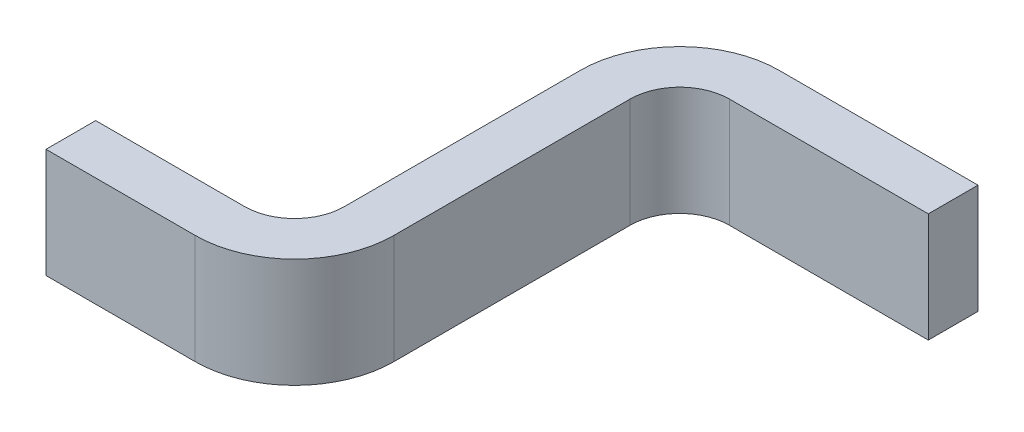
ISO-10303-21;
HEADER;
FILE_DESCRIPTION(('STEP AP214'),'2;1');
FILE_NAME('part.step','',(''),(''),'','','');
FILE_SCHEMA(('AUTOMOTIVE_DESIGN { 1 0 10303 214 1 1 1 1 }'));
ENDSEC;
DATA;
#1=APPLICATION_CONTEXT('core data for automotive mechanical design processes');
#2=APPLICATION_PROTOCOL_DEFINITION('international standard','automotive_design',2000,#1);
#3=PRODUCT_CONTEXT('',#1,'mechanical');
#4=PRODUCT('Part','Part','',(#3));
#5=PRODUCT_RELATED_PRODUCT_CATEGORY('part','',(#4));
#6=PRODUCT_DEFINITION_FORMATION('','',#4);
#7=PRODUCT_DEFINITION_CONTEXT('part definition',#1,'design');
#8=PRODUCT_DEFINITION('design','',#6,#7);
#9=PRODUCT_DEFINITION_SHAPE('','',#8);
#10=(LENGTH_UNIT() NAMED_UNIT(*) SI_UNIT(.MILLI.,.METRE.));
#11=(NAMED_UNIT(*) PLANE_ANGLE_UNIT() SI_UNIT($,.RADIAN.));
#12=(NAMED_UNIT(*) SI_UNIT($,.STERADIAN.) SOLID_ANGLE_UNIT());
#13=UNCERTAINTY_MEASURE_WITH_UNIT(LENGTH_MEASURE(1.E-05),#10,'distance_accuracy_value','');
#14=(GEOMETRIC_REPRESENTATION_CONTEXT(3) GLOBAL_UNCERTAINTY_ASSIGNED_CONTEXT((#13)) GLOBAL_UNIT_ASSIGNED_CONTEXT((#10,
#11,#12)) REPRESENTATION_CONTEXT('',''));
#15=CARTESIAN_POINT('',(0.,0.,0.));
#16=DIRECTION('',(0.,0.,1.));
#17=DIRECTION('',(1.,0.,0.));
#18=AXIS2_PLACEMENT_3D('',#15,#16,#17);
#19=CARTESIAN_POINT('',(3.9,-0.14,0.675));
#20=DIRECTION('',(0.,-1.,0.));
#21=DIRECTION('',(0.,0.,-1.));
#22=AXIS2_PLACEMENT_3D('',#19,#20,#21);
#23=PLANE('',#22);
#24=CARTESIAN_POINT('',(3.8,-0.14,0.675));
#25=DIRECTION('',(0.,-1.,0.));
#26=DIRECTION('',(0.,0.,-1.));
#27=AXIS2_PLACEMENT_3D('',#24,#25,#26);
#28=CIRCLE('',#27,0.1);
#29=CARTESIAN_POINT('',(3.9,-0.14,0.675));
#30=VERTEX_POINT('',#29);
#31=CARTESIAN_POINT('',(3.8,-0.14,0.775));
#32=VERTEX_POINT('',#31);
#33=EDGE_CURVE('E162',#30,#32,#28,.T.);
#34=ORIENTED_EDGE('',*,*,#33,.T.);
#35=DIRECTION('',(1.,0.,0.));
#36=VECTOR('',#35,1.);
#37=CARTESIAN_POINT('',(3.5,-0.14,0.775));
#38=LINE('',#37,#36);
#39=CARTESIAN_POINT('',(3.5,-0.14,0.775));
#40=VERTEX_POINT('',#39);
#41=EDGE_CURVE('E120',#32,#40,#38,.F.);
#42=ORIENTED_EDGE('',*,*,#41,.T.);
#43=DIRECTION('',(0.,0.,1.));
#44=VECTOR('',#43,1.);
#45=CARTESIAN_POINT('',(3.5,-0.14,0.775));
#46=LINE('',#45,#44);
#47=CARTESIAN_POINT('',(3.5,-0.14,0.875));
#48=VERTEX_POINT('',#47);
#49=EDGE_CURVE('E116',#48,#40,#46,.F.);
#50=ORIENTED_EDGE('',*,*,#49,.F.);
#51=DIRECTION('',(-1.,0.,0.));
#52=VECTOR('',#51,1.);
#53=CARTESIAN_POINT('',(3.5,-0.14,0.875));
#54=LINE('',#53,#52);
#55=CARTESIAN_POINT('',(3.8,-0.14,0.875));
#56=VERTEX_POINT('',#55);
#57=EDGE_CURVE('E111',#48,#56,#54,.F.);
#58=ORIENTED_EDGE('',*,*,#57,.T.);
#59=CARTESIAN_POINT('',(3.8,-0.14,0.675));
#60=DIRECTION('',(0.,-1.,0.));
#61=DIRECTION('',(0.,0.,-1.));
#62=AXIS2_PLACEMENT_3D('',#59,#60,#61);
#63=CIRCLE('',#62,0.2);
#64=CARTESIAN_POINT('',(4.,-0.14,0.675));
#65=VERTEX_POINT('',#64);
#66=EDGE_CURVE('E102',#65,#56,#63,.T.);
#67=ORIENTED_EDGE('',*,*,#66,.F.);
#68=DIRECTION('',(0.,0.,1.));
#69=VECTOR('',#68,1.);
#70=CARTESIAN_POINT('',(4.,-0.14,0.675));
#71=LINE('',#70,#69);
#72=CARTESIAN_POINT('',(4.,-0.14,0.2));
#73=VERTEX_POINT('',#72);
#74=EDGE_CURVE('E98',#65,#73,#71,.F.);
#75=ORIENTED_EDGE('',*,*,#74,.T.);
#76=CARTESIAN_POINT('',(4.1,-0.14,0.2));
#77=DIRECTION('',(0.,1.,0.));
#78=DIRECTION('',(0.,0.,1.));
#79=AXIS2_PLACEMENT_3D('',#76,#77,#78);
#80=CIRCLE('',#79,0.1);
#81=CARTESIAN_POINT('',(4.1,-0.14,0.1));
#82=VERTEX_POINT('',#81);
#83=EDGE_CURVE('E20',#73,#82,#80,.F.);
#84=ORIENTED_EDGE('',*,*,#83,.T.);
#85=DIRECTION('',(-1.,0.,0.));
#86=VECTOR('',#85,1.);
#87=CARTESIAN_POINT('',(4.1,-0.14,0.1));
#88=LINE('',#87,#86);
#89=CARTESIAN_POINT('',(4.5,-0.14,0.1));
#90=VERTEX_POINT('',#89);
#91=EDGE_CURVE('E145',#82,#90,#88,.F.);
#92=ORIENTED_EDGE('',*,*,#91,.T.);
#93=DIRECTION('',(0.,0.,1.));
#94=VECTOR('',#93,1.);
#95=CARTESIAN_POINT('',(4.5,-0.14,0.));
#96=LINE('',#95,#94);
#97=CARTESIAN_POINT('',(4.5,-0.14,0.));
#98=VERTEX_POINT('',#97);
#99=EDGE_CURVE('E139',#90,#98,#96,.F.);
#100=ORIENTED_EDGE('',*,*,#99,.T.);
#101=DIRECTION('',(1.,0.,0.));
#102=VECTOR('',#101,1.);
#103=CARTESIAN_POINT('',(4.1,-0.14,0.));
#104=LINE('',#103,#102);
#105=CARTESIAN_POINT('',(4.1,-0.14,0.));
#106=VERTEX_POINT('',#105);
#107=EDGE_CURVE('E132',#98,#106,#104,.F.);
#108=ORIENTED_EDGE('',*,*,#107,.T.);
#109=CARTESIAN_POINT('',(4.1,-0.14,0.2));
#110=DIRECTION('',(0.,1.,0.));
#111=DIRECTION('',(0.,0.,1.));
#112=AXIS2_PLACEMENT_3D('',#109,#110,#111);
#113=CIRCLE('',#112,0.2);
#114=CARTESIAN_POINT('',(3.9,-0.14,0.2));
#115=VERTEX_POINT('',#114);
#116=EDGE_CURVE('E135',#115,#106,#113,.F.);
#117=ORIENTED_EDGE('',*,*,#116,.F.);
#118=DIRECTION('',(0.,0.,-1.));
#119=VECTOR('',#118,1.);
#120=CARTESIAN_POINT('',(3.9,-0.14,0.675));
#121=LINE('',#120,#119);
#122=EDGE_CURVE('E128',#115,#30,#121,.F.);
#123=ORIENTED_EDGE('',*,*,#122,.T.);
#124=EDGE_LOOP('',(#34,#42,#50,#58,#67,#75,#84,#92,#100,#108,#117,#123));
#125=FACE_BOUND('',#124,.T.);
#126=ADVANCED_FACE('F17',(#125),#23,.F.);
#127=CARTESIAN_POINT('',(4.1,-0.14,0.2));
#128=DIRECTION('',(0.,1.,0.));
#129=DIRECTION('',(0.,0.,1.));
#130=AXIS2_PLACEMENT_3D('',#127,#128,#129);
#131=CYLINDRICAL_SURFACE('',#130,0.1);
#132=DIRECTION('',(0.,1.,0.));
#133=VECTOR('',#132,1.);
#134=CARTESIAN_POINT('',(4.,-0.14,0.2));
#135=LINE('',#134,#133);
#136=CARTESIAN_POINT('',(4.,-0.36,0.2));
#137=VERTEX_POINT('',#136);
#138=EDGE_CURVE('E91',#73,#137,#135,.F.);
#139=ORIENTED_EDGE('',*,*,#138,.T.);
#140=CARTESIAN_POINT('',(4.1,-0.36,0.2));
#141=DIRECTION('',(0.,1.,0.));
#142=DIRECTION('',(0.,0.,1.));
#143=AXIS2_PLACEMENT_3D('',#140,#141,#142);
#144=CIRCLE('',#143,0.1);
#145=CARTESIAN_POINT('',(4.1,-0.36,0.1));
#146=VERTEX_POINT('',#145);
#147=EDGE_CURVE('E103',#137,#146,#144,.F.);
#148=ORIENTED_EDGE('',*,*,#147,.T.);
#149=DIRECTION('',(0.,1.,0.));
#150=VECTOR('',#149,1.);
#151=CARTESIAN_POINT('',(4.1,-0.14,0.1));
#152=LINE('',#151,#150);
#153=EDGE_CURVE('E92',#146,#82,#152,.T.);
#154=ORIENTED_EDGE('',*,*,#153,.T.);
#155=ORIENTED_EDGE('',*,*,#83,.F.);
#156=EDGE_LOOP('',(#139,#148,#154,#155));
#157=FACE_BOUND('',#156,.T.);
#158=ADVANCED_FACE('F89',(#157),#131,.F.);
#159=CARTESIAN_POINT('',(4.1,-0.14,0.1));
#160=DIRECTION('',(0.,0.,-1.));
#161=DIRECTION('',(-1.,0.,0.));
#162=AXIS2_PLACEMENT_3D('',#159,#160,#161);
#163=PLANE('',#162);
#164=ORIENTED_EDGE('',*,*,#153,.F.);
#165=DIRECTION('',(1.,0.,0.));
#166=VECTOR('',#165,1.);
#167=CARTESIAN_POINT('',(4.,-0.36,0.1));
#168=LINE('',#167,#166);
#169=CARTESIAN_POINT('',(4.5,-0.36,0.1));
#170=VERTEX_POINT('',#169);
#171=EDGE_CURVE('E105',#146,#170,#168,.T.);
#172=ORIENTED_EDGE('',*,*,#171,.T.);
#173=DIRECTION('',(0.,1.,0.));
#174=VECTOR('',#173,1.);
#175=CARTESIAN_POINT('',(4.5,-0.36,0.1));
#176=LINE('',#175,#174);
#177=EDGE_CURVE('E142',#170,#90,#176,.T.);
#178=ORIENTED_EDGE('',*,*,#177,.T.);
#179=ORIENTED_EDGE('',*,*,#91,.F.);
#180=EDGE_LOOP('',(#164,#172,#178,#179));
#181=FACE_BOUND('',#180,.T.);
#182=ADVANCED_FACE('F187',(#181),#163,.F.);
#183=CARTESIAN_POINT('',(4.5,-0.36,0.));
#184=DIRECTION('',(-1.,0.,0.));
#185=DIRECTION('',(0.,0.,1.));
#186=AXIS2_PLACEMENT_3D('',#183,#184,#185);
#187=PLANE('',#186);
#188=ORIENTED_EDGE('',*,*,#177,.F.);
#189=DIRECTION('',(0.,0.,1.));
#190=VECTOR('',#189,1.);
#191=CARTESIAN_POINT('',(4.5,-0.36,0.675));
#192=LINE('',#191,#190);
#193=CARTESIAN_POINT('',(4.5,-0.36,0.));
#194=VERTEX_POINT('',#193);
#195=EDGE_CURVE('E176',#170,#194,#192,.F.);
#196=ORIENTED_EDGE('',*,*,#195,.T.);
#197=DIRECTION('',(0.,1.,0.));
#198=VECTOR('',#197,1.);
#199=CARTESIAN_POINT('',(4.5,-0.36,0.));
#200=LINE('',#199,#198);
#201=EDGE_CURVE('E136',#194,#98,#200,.T.);
#202=ORIENTED_EDGE('',*,*,#201,.T.);
#203=ORIENTED_EDGE('',*,*,#99,.F.);
#204=EDGE_LOOP('',(#188,#196,#202,#203));
#205=FACE_BOUND('',#204,.T.);
#206=ADVANCED_FACE('F192',(#205),#187,.F.);
#207=CARTESIAN_POINT('',(4.1,-0.36,0.));
#208=DIRECTION('',(0.,0.,1.));
#209=DIRECTION('',(1.,0.,0.));
#210=AXIS2_PLACEMENT_3D('',#207,#208,#209);
#211=PLANE('',#210);
#212=DIRECTION('',(0.,1.,0.));
#213=VECTOR('',#212,1.);
#214=CARTESIAN_POINT('',(4.1,-0.36,0.));
#215=LINE('',#214,#213);
#216=CARTESIAN_POINT('',(4.1,-0.36,0.));
#217=VERTEX_POINT('',#216);
#218=EDGE_CURVE('E163',#106,#217,#215,.F.);
#219=ORIENTED_EDGE('',*,*,#218,.F.);
#220=ORIENTED_EDGE('',*,*,#107,.F.);
#221=ORIENTED_EDGE('',*,*,#201,.F.);
#222=DIRECTION('',(1.,0.,0.));
#223=VECTOR('',#222,1.);
#224=CARTESIAN_POINT('',(4.,-0.36,0.));
#225=LINE('',#224,#223);
#226=EDGE_CURVE('E159',#194,#217,#225,.F.);
#227=ORIENTED_EDGE('',*,*,#226,.T.);
#228=EDGE_LOOP('',(#219,#220,#221,#227));
#229=FACE_BOUND('',#228,.T.);
#230=ADVANCED_FACE('F264',(#229),#211,.F.);
#231=CARTESIAN_POINT('',(4.1,-0.36,0.2));
#232=DIRECTION('',(0.,1.,0.));
#233=DIRECTION('',(0.,0.,1.));
#234=AXIS2_PLACEMENT_3D('',#231,#232,#233);
#235=CYLINDRICAL_SURFACE('',#234,0.2);
#236=ORIENTED_EDGE('',*,*,#116,.T.);
#237=ORIENTED_EDGE('',*,*,#218,.T.);
#238=CARTESIAN_POINT('',(4.1,-0.36,0.2));
#239=DIRECTION('',(0.,1.,0.));
#240=DIRECTION('',(0.,0.,1.));
#241=AXIS2_PLACEMENT_3D('',#238,#239,#240);
#242=CIRCLE('',#241,0.2);
#243=CARTESIAN_POINT('',(3.9,-0.36,0.2));
#244=VERTEX_POINT('',#243);
#245=EDGE_CURVE('E157',#217,#244,#242,.T.);
#246=ORIENTED_EDGE('',*,*,#245,.T.);
#247=DIRECTION('',(0.,1.,0.));
#248=VECTOR('',#247,1.);
#249=CARTESIAN_POINT('',(3.9,-0.36,0.2));
#250=LINE('',#249,#248);
#251=EDGE_CURVE('E131',#244,#115,#250,.T.);
#252=ORIENTED_EDGE('',*,*,#251,.T.);
#253=EDGE_LOOP('',(#236,#237,#246,#252));
#254=FACE_BOUND('',#253,.T.);
#255=ADVANCED_FACE('F266',(#254),#235,.T.);
#256=CARTESIAN_POINT('',(3.9,-0.36,0.675));
#257=DIRECTION('',(1.,0.,0.));
#258=DIRECTION('',(0.,0.,-1.));
#259=AXIS2_PLACEMENT_3D('',#256,#257,#258);
#260=PLANE('',#259);
#261=DIRECTION('',(0.,-1.,0.));
#262=VECTOR('',#261,1.);
#263=CARTESIAN_POINT('',(3.9,-0.36,0.675));
#264=LINE('',#263,#262);
#265=CARTESIAN_POINT('',(3.9,-0.36,0.675));
#266=VERTEX_POINT('',#265);
#267=EDGE_CURVE('E130',#266,#30,#264,.F.);
#268=ORIENTED_EDGE('',*,*,#267,.T.);
#269=ORIENTED_EDGE('',*,*,#122,.F.);
#270=ORIENTED_EDGE('',*,*,#251,.F.);
#271=DIRECTION('',(0.,0.,1.));
#272=VECTOR('',#271,1.);
#273=CARTESIAN_POINT('',(3.9,-0.36,0.675));
#274=LINE('',#273,#272);
#275=EDGE_CURVE('E156',#244,#266,#274,.T.);
#276=ORIENTED_EDGE('',*,*,#275,.T.);
#277=EDGE_LOOP('',(#268,#269,#270,#276));
#278=FACE_BOUND('',#277,.T.);
#279=ADVANCED_FACE('F231',(#278),#260,.F.);
#280=CARTESIAN_POINT('',(3.8,-0.36,0.675));
#281=DIRECTION('',(0.,-1.,0.));
#282=DIRECTION('',(0.,0.,-1.));
#283=AXIS2_PLACEMENT_3D('',#280,#281,#282);
#284=CYLINDRICAL_SURFACE('',#283,0.1);
#285=DIRECTION('',(0.,1.,0.));
#286=VECTOR('',#285,1.);
#287=CARTESIAN_POINT('',(3.8,-0.36,0.775));
#288=LINE('',#287,#286);
#289=CARTESIAN_POINT('',(3.8,-0.36,0.775));
#290=VERTEX_POINT('',#289);
#291=EDGE_CURVE('E125',#290,#32,#288,.T.);
#292=ORIENTED_EDGE('',*,*,#291,.T.);
#293=ORIENTED_EDGE('',*,*,#33,.F.);
#294=ORIENTED_EDGE('',*,*,#267,.F.);
#295=CARTESIAN_POINT('',(3.8,-0.36,0.675));
#296=DIRECTION('',(0.,-1.,0.));
#297=DIRECTION('',(0.,0.,-1.));
#298=AXIS2_PLACEMENT_3D('',#295,#296,#297);
#299=CIRCLE('',#298,0.1);
#300=EDGE_CURVE('E152',#266,#290,#299,.T.);
#301=ORIENTED_EDGE('',*,*,#300,.T.);
#302=EDGE_LOOP('',(#292,#293,#294,#301));
#303=FACE_BOUND('',#302,.T.);
#304=ADVANCED_FACE('F235',(#303),#284,.F.);
#305=CARTESIAN_POINT('',(3.5,-0.36,0.775));
#306=DIRECTION('',(0.,0.,1.));
#307=DIRECTION('',(1.,0.,0.));
#308=AXIS2_PLACEMENT_3D('',#305,#306,#307);
#309=PLANE('',#308);
#310=DIRECTION('',(0.,1.,0.));
#311=VECTOR('',#310,1.);
#312=CARTESIAN_POINT('',(3.5,-0.36,0.775));
#313=LINE('',#312,#311);
#314=CARTESIAN_POINT('',(3.5,-0.36,0.775));
#315=VERTEX_POINT('',#314);
#316=EDGE_CURVE('E119',#40,#315,#313,.F.);
#317=ORIENTED_EDGE('',*,*,#316,.F.);
#318=ORIENTED_EDGE('',*,*,#41,.F.);
#319=ORIENTED_EDGE('',*,*,#291,.F.);
#320=DIRECTION('',(1.,0.,0.));
#321=VECTOR('',#320,1.);
#322=CARTESIAN_POINT('',(4.,-0.36,0.775));
#323=LINE('',#322,#321);
#324=EDGE_CURVE('E155',#290,#315,#323,.F.);
#325=ORIENTED_EDGE('',*,*,#324,.T.);
#326=EDGE_LOOP('',(#317,#318,#319,#325));
#327=FACE_BOUND('',#326,.T.);
#328=ADVANCED_FACE('F259',(#327),#309,.F.);
#329=CARTESIAN_POINT('',(3.5,-0.36,0.775));
#330=DIRECTION('',(-1.,0.,0.));
#331=DIRECTION('',(0.,0.,1.));
#332=AXIS2_PLACEMENT_3D('',#329,#330,#331);
#333=PLANE('',#332);
#334=DIRECTION('',(0.,0.,1.));
#335=VECTOR('',#334,1.);
#336=CARTESIAN_POINT('',(3.5,-0.36,0.675));
#337=LINE('',#336,#335);
#338=CARTESIAN_POINT('',(3.5,-0.36,0.875));
#339=VERTEX_POINT('',#338);
#340=EDGE_CURVE('E217',#315,#339,#337,.T.);
#341=ORIENTED_EDGE('',*,*,#340,.T.);
#342=DIRECTION('',(0.,1.,0.));
#343=VECTOR('',#342,1.);
#344=CARTESIAN_POINT('',(3.5,-0.14,0.875));
#345=LINE('',#344,#343);
#346=EDGE_CURVE('E113',#339,#48,#345,.T.);
#347=ORIENTED_EDGE('',*,*,#346,.T.);
#348=ORIENTED_EDGE('',*,*,#49,.T.);
#349=ORIENTED_EDGE('',*,*,#316,.T.);
#350=EDGE_LOOP('',(#341,#347,#348,#349));
#351=FACE_BOUND('',#350,.T.);
#352=ADVANCED_FACE('F255',(#351),#333,.T.);
#353=CARTESIAN_POINT('',(3.5,-0.14,0.875));
#354=DIRECTION('',(0.,0.,-1.));
#355=DIRECTION('',(-1.,0.,0.));
#356=AXIS2_PLACEMENT_3D('',#353,#354,#355);
#357=PLANE('',#356);
#358=ORIENTED_EDGE('',*,*,#346,.F.);
#359=DIRECTION('',(1.,0.,0.));
#360=VECTOR('',#359,1.);
#361=CARTESIAN_POINT('',(4.,-0.36,0.875));
#362=LINE('',#361,#360);
#363=CARTESIAN_POINT('',(3.8,-0.36,0.875));
#364=VERTEX_POINT('',#363);
#365=EDGE_CURVE('E151',#339,#364,#362,.T.);
#366=ORIENTED_EDGE('',*,*,#365,.T.);
#367=DIRECTION('',(0.,-1.,0.));
#368=VECTOR('',#367,1.);
#369=CARTESIAN_POINT('',(3.8,-0.14,0.875));
#370=LINE('',#369,#368);
#371=EDGE_CURVE('E99',#56,#364,#370,.T.);
#372=ORIENTED_EDGE('',*,*,#371,.F.);
#373=ORIENTED_EDGE('',*,*,#57,.F.);
#374=EDGE_LOOP('',(#358,#366,#372,#373));
#375=FACE_BOUND('',#374,.T.);
#376=ADVANCED_FACE('F251',(#375),#357,.F.);
#377=CARTESIAN_POINT('',(3.8,-0.14,0.675));
#378=DIRECTION('',(0.,-1.,0.));
#379=DIRECTION('',(0.,0.,-1.));
#380=AXIS2_PLACEMENT_3D('',#377,#378,#379);
#381=CYLINDRICAL_SURFACE('',#380,0.2);
#382=CARTESIAN_POINT('',(3.8,-0.36,0.675));
#383=DIRECTION('',(0.,-1.,0.));
#384=DIRECTION('',(0.,0.,-1.));
#385=AXIS2_PLACEMENT_3D('',#382,#383,#384);
#386=CIRCLE('',#385,0.2);
#387=CARTESIAN_POINT('',(4.,-0.36,0.675));
#388=VERTEX_POINT('',#387);
#389=EDGE_CURVE('E26',#364,#388,#386,.F.);
#390=ORIENTED_EDGE('',*,*,#389,.T.);
#391=DIRECTION('',(0.,1.,0.));
#392=VECTOR('',#391,1.);
#393=CARTESIAN_POINT('',(4.,-0.14,0.675));
#394=LINE('',#393,#392);
#395=EDGE_CURVE('E34',#388,#65,#394,.T.);
#396=ORIENTED_EDGE('',*,*,#395,.T.);
#397=ORIENTED_EDGE('',*,*,#66,.T.);
#398=ORIENTED_EDGE('',*,*,#371,.T.);
#399=EDGE_LOOP('',(#390,#396,#397,#398));
#400=FACE_BOUND('',#399,.T.);
#401=ADVANCED_FACE('F280',(#400),#381,.T.);
#402=CARTESIAN_POINT('',(4.,-0.14,0.675));
#403=DIRECTION('',(-1.,0.,0.));
#404=DIRECTION('',(0.,0.,1.));
#405=AXIS2_PLACEMENT_3D('',#402,#403,#404);
#406=PLANE('',#405);
#407=ORIENTED_EDGE('',*,*,#395,.F.);
#408=DIRECTION('',(0.,0.,1.));
#409=VECTOR('',#408,1.);
#410=CARTESIAN_POINT('',(4.,-0.36,0.675));
#411=LINE('',#410,#409);
#412=EDGE_CURVE('E11',#388,#137,#411,.F.);
#413=ORIENTED_EDGE('',*,*,#412,.T.);
#414=ORIENTED_EDGE('',*,*,#138,.F.);
#415=ORIENTED_EDGE('',*,*,#74,.F.);
#416=EDGE_LOOP('',(#407,#413,#414,#415));
#417=FACE_BOUND('',#416,.T.);
#418=ADVANCED_FACE('F97',(#417),#406,.F.);
#419=CARTESIAN_POINT('',(4.,-0.36,0.675));
#420=DIRECTION('',(0.,1.,0.));
#421=DIRECTION('',(0.,0.,1.));
#422=AXIS2_PLACEMENT_3D('',#419,#420,#421);
#423=PLANE('',#422);
#424=ORIENTED_EDGE('',*,*,#389,.F.);
#425=ORIENTED_EDGE('',*,*,#365,.F.);
#426=ORIENTED_EDGE('',*,*,#340,.F.);
#427=ORIENTED_EDGE('',*,*,#324,.F.);
#428=ORIENTED_EDGE('',*,*,#300,.F.);
#429=ORIENTED_EDGE('',*,*,#275,.F.);
#430=ORIENTED_EDGE('',*,*,#245,.F.);
#431=ORIENTED_EDGE('',*,*,#226,.F.);
#432=ORIENTED_EDGE('',*,*,#195,.F.);
#433=ORIENTED_EDGE('',*,*,#171,.F.);
#434=ORIENTED_EDGE('',*,*,#147,.F.);
#435=ORIENTED_EDGE('',*,*,#412,.F.);
#436=EDGE_LOOP('',(#424,#425,#426,#427,#428,#429,#430,#431,#432,#433,#434,#435));
#437=FACE_BOUND('',#436,.T.);
#438=ADVANCED_FACE('F197',(#437),#423,.F.);
#439=CLOSED_SHELL('',(#126,#158,#182,#206,#230,#255,#279,#304,#328,#352,#376,#401,#418,#438));
#440=MANIFOLD_SOLID_BREP('B1',#439);
#441=ADVANCED_BREP_SHAPE_REPRESENTATION('',(#18,#440),#14);
#442=SHAPE_DEFINITION_REPRESENTATION(#9,#441);
ENDSEC;
END-ISO-10303-21;
